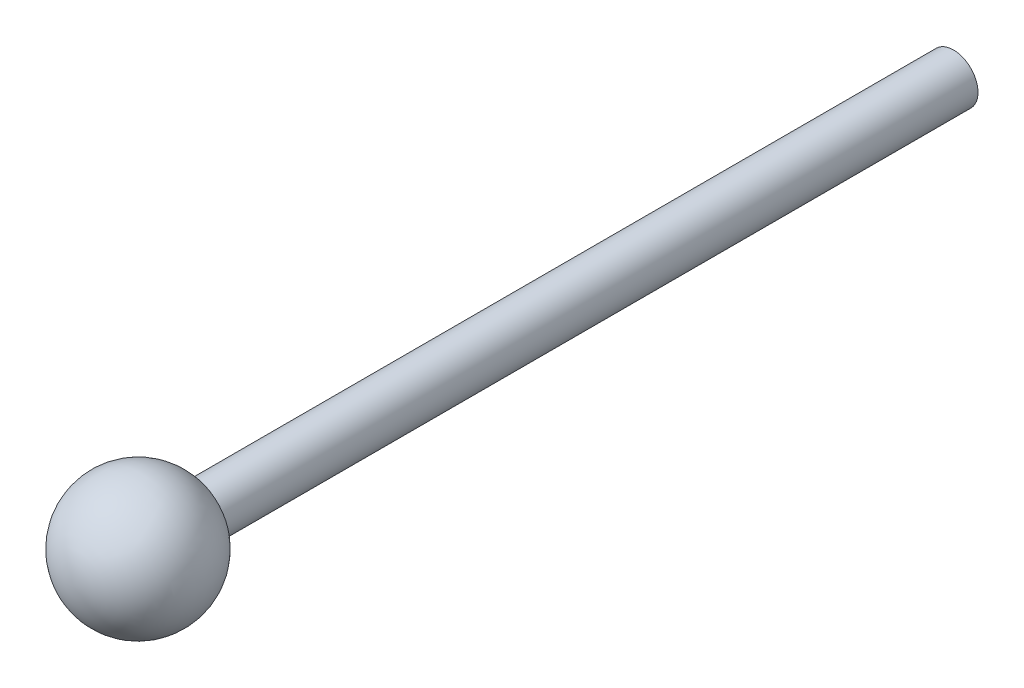
ISO-10303-21;
HEADER;
FILE_DESCRIPTION(('STEP AP214'),'2;1');
FILE_NAME('part.step','',(''),(''),'','','');
FILE_SCHEMA(('AUTOMOTIVE_DESIGN { 1 0 10303 214 1 1 1 1 }'));
ENDSEC;
DATA;
#1=APPLICATION_CONTEXT('core data for automotive mechanical design processes');
#2=APPLICATION_PROTOCOL_DEFINITION('international standard','automotive_design',2000,#1);
#3=PRODUCT_CONTEXT('',#1,'mechanical');
#4=PRODUCT('Part','Part','',(#3));
#5=PRODUCT_RELATED_PRODUCT_CATEGORY('part','',(#4));
#6=PRODUCT_DEFINITION_FORMATION('','',#4);
#7=PRODUCT_DEFINITION_CONTEXT('part definition',#1,'design');
#8=PRODUCT_DEFINITION('design','',#6,#7);
#9=PRODUCT_DEFINITION_SHAPE('','',#8);
#10=(LENGTH_UNIT() NAMED_UNIT(*) SI_UNIT(.MILLI.,.METRE.));
#11=(NAMED_UNIT(*) PLANE_ANGLE_UNIT() SI_UNIT($,.RADIAN.));
#12=(NAMED_UNIT(*) SI_UNIT($,.STERADIAN.) SOLID_ANGLE_UNIT());
#13=UNCERTAINTY_MEASURE_WITH_UNIT(LENGTH_MEASURE(1.E-05),#10,'distance_accuracy_value','');
#14=(GEOMETRIC_REPRESENTATION_CONTEXT(3) GLOBAL_UNCERTAINTY_ASSIGNED_CONTEXT((#13)) GLOBAL_UNIT_ASSIGNED_CONTEXT((#10,
#11,#12)) REPRESENTATION_CONTEXT('',''));
#15=CARTESIAN_POINT('',(0.,0.,0.));
#16=DIRECTION('',(0.,0.,1.));
#17=DIRECTION('',(1.,0.,0.));
#18=AXIS2_PLACEMENT_3D('',#15,#16,#17);
#19=CARTESIAN_POINT('',(0.,0.,0.));
#20=DIRECTION('',(0.,1.,0.));
#21=DIRECTION('',(-1.,0.,0.));
#22=AXIS2_PLACEMENT_3D('',#19,#20,#21);
#23=SPHERICAL_SURFACE('',#22,20.32);
#24=CARTESIAN_POINT('',(0.,0.,0.));
#25=DIRECTION('',(0.,0.,1.));
#26=DIRECTION('',(1.,0.,0.));
#27=AXIS2_PLACEMENT_3D('',#24,#25,#26);
#28=SPHERICAL_SURFACE('',#27,20.32);
#29=CARTESIAN_POINT('',(0.,0.,-18.837144157223));
#30=DIRECTION('',(0.,0.,1.));
#31=DIRECTION('',(1.,0.,0.));
#32=AXIS2_PLACEMENT_3D('',#29,#30,#31);
#33=CIRCLE('',#32,7.62);
#34=CARTESIAN_POINT('',(7.62,0.,-18.837144157223));
#35=VERTEX_POINT('',#34);
#36=EDGE_CURVE('E10',#35,#35,#33,.F.);
#37=ORIENTED_EDGE('',*,*,#36,.F.);
#38=EDGE_LOOP('',(#37));
#39=FACE_BOUND('',#38,.T.);
#40=ADVANCED_FACE('F37',(#39),#28,.T.);
#41=CARTESIAN_POINT('',(0.,0.,-254.));
#42=DIRECTION('',(0.,0.,1.));
#43=DIRECTION('',(1.,0.,0.));
#44=AXIS2_PLACEMENT_3D('',#41,#42,#43);
#45=CYLINDRICAL_SURFACE('',#44,7.62);
#46=CARTESIAN_POINT('',(0.,0.,-254.));
#47=DIRECTION('',(0.,0.,1.));
#48=DIRECTION('',(1.,0.,0.));
#49=AXIS2_PLACEMENT_3D('',#46,#47,#48);
#50=CIRCLE('',#49,7.62);
#51=CARTESIAN_POINT('',(7.62,0.,-254.));
#52=VERTEX_POINT('',#51);
#53=EDGE_CURVE('E44',#52,#52,#50,.T.);
#54=ORIENTED_EDGE('',*,*,#53,.T.);
#55=EDGE_LOOP('',(#54));
#56=FACE_BOUND('',#55,.T.);
#57=ORIENTED_EDGE('',*,*,#36,.T.);
#58=EDGE_LOOP('',(#57));
#59=FACE_BOUND('',#58,.T.);
#60=ADVANCED_FACE('F39',(#56,#59),#45,.T.);
#61=CARTESIAN_POINT('',(0.,0.,-254.));
#62=DIRECTION('',(0.,0.,1.));
#63=DIRECTION('',(1.,0.,0.));
#64=AXIS2_PLACEMENT_3D('',#61,#62,#63);
#65=PLANE('',#64);
#66=ORIENTED_EDGE('',*,*,#53,.F.);
#67=EDGE_LOOP('',(#66));
#68=FACE_BOUND('',#67,.T.);
#69=ADVANCED_FACE('F51',(#68),#65,.F.);
#70=CLOSED_SHELL('',(#40,#60,#69));
#71=MANIFOLD_SOLID_BREP('B2',#70);
#72=ADVANCED_BREP_SHAPE_REPRESENTATION('',(#18,#71),#14);
#73=SHAPE_DEFINITION_REPRESENTATION(#9,#72);
ENDSEC;
END-ISO-10303-21;
